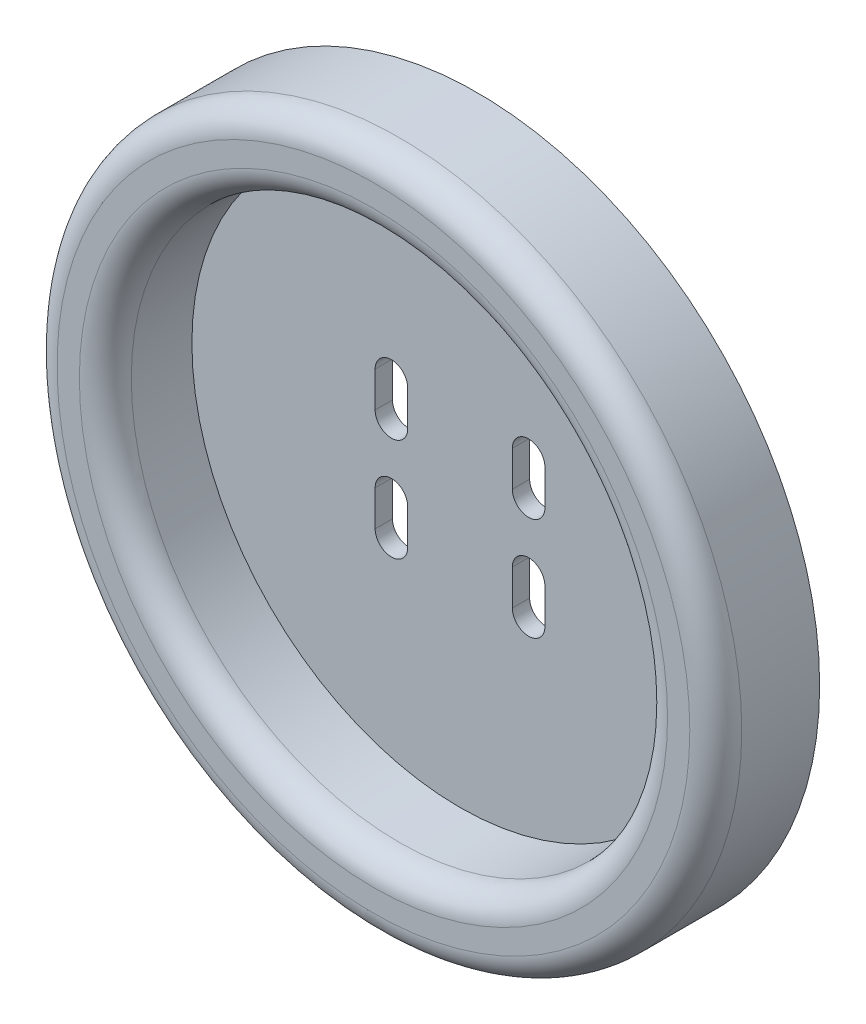
ISO-10303-21;
HEADER;
FILE_DESCRIPTION(('STEP AP214'),'2;1');
FILE_NAME('part.step','',(''),(''),'','','');
FILE_SCHEMA(('AUTOMOTIVE_DESIGN { 1 0 10303 214 1 1 1 1 }'));
ENDSEC;
DATA;
#1=APPLICATION_CONTEXT('core data for automotive mechanical design processes');
#2=APPLICATION_PROTOCOL_DEFINITION('international standard','automotive_design',2000,#1);
#3=PRODUCT_CONTEXT('',#1,'mechanical');
#4=PRODUCT('Part','Part','',(#3));
#5=PRODUCT_RELATED_PRODUCT_CATEGORY('part','',(#4));
#6=PRODUCT_DEFINITION_FORMATION('','',#4);
#7=PRODUCT_DEFINITION_CONTEXT('part definition',#1,'design');
#8=PRODUCT_DEFINITION('design','',#6,#7);
#9=PRODUCT_DEFINITION_SHAPE('','',#8);
#10=(LENGTH_UNIT() NAMED_UNIT(*) SI_UNIT(.MILLI.,.METRE.));
#11=(NAMED_UNIT(*) PLANE_ANGLE_UNIT() SI_UNIT($,.RADIAN.));
#12=(NAMED_UNIT(*) SI_UNIT($,.STERADIAN.) SOLID_ANGLE_UNIT());
#13=UNCERTAINTY_MEASURE_WITH_UNIT(LENGTH_MEASURE(1.E-05),#10,'distance_accuracy_value','');
#14=(GEOMETRIC_REPRESENTATION_CONTEXT(3) GLOBAL_UNCERTAINTY_ASSIGNED_CONTEXT((#13)) GLOBAL_UNIT_ASSIGNED_CONTEXT((#10,
#11,#12)) REPRESENTATION_CONTEXT('',''));
#15=CARTESIAN_POINT('',(0.,0.,0.));
#16=DIRECTION('',(0.,0.,1.));
#17=DIRECTION('',(1.,0.,0.));
#18=AXIS2_PLACEMENT_3D('',#15,#16,#17);
#19=CARTESIAN_POINT('',(0.,0.,12.));
#20=DIRECTION('',(0.,0.,-1.));
#21=DIRECTION('',(-1.,0.,0.));
#22=AXIS2_PLACEMENT_3D('',#19,#20,#21);
#23=CYLINDRICAL_SURFACE('',#22,39.5490349627969);
#24=CARTESIAN_POINT('',(0.,0.,9.));
#25=DIRECTION('',(0.,0.,1.));
#26=DIRECTION('',(1.,0.,0.));
#27=AXIS2_PLACEMENT_3D('',#24,#25,#26);
#28=CIRCLE('',#27,39.5490349627969);
#29=CARTESIAN_POINT('',(39.5490349627969,0.,9.));
#30=VERTEX_POINT('',#29);
#31=EDGE_CURVE('E298',#30,#30,#28,.F.);
#32=ORIENTED_EDGE('',*,*,#31,.T.);
#33=EDGE_LOOP('',(#32));
#34=FACE_BOUND('',#33,.T.);
#35=CARTESIAN_POINT('',(0.,0.,0.));
#36=DIRECTION('',(0.,0.,1.));
#37=DIRECTION('',(1.,0.,0.));
#38=AXIS2_PLACEMENT_3D('',#35,#36,#37);
#39=CIRCLE('',#38,39.5490349627969);
#40=CARTESIAN_POINT('',(39.5490349627969,0.,0.));
#41=VERTEX_POINT('',#40);
#42=EDGE_CURVE('E292',#41,#41,#39,.T.);
#43=ORIENTED_EDGE('',*,*,#42,.T.);
#44=EDGE_LOOP('',(#43));
#45=FACE_BOUND('',#44,.T.);
#46=ADVANCED_FACE('F40',(#34,#45),#23,.T.);
#47=CARTESIAN_POINT('',(0.,0.,12.));
#48=DIRECTION('',(0.,0.,1.));
#49=DIRECTION('',(1.,0.,0.));
#50=AXIS2_PLACEMENT_3D('',#47,#48,#49);
#51=PLANE('',#50);
#52=CARTESIAN_POINT('',(0.,0.,12.));
#53=DIRECTION('',(0.,0.,1.));
#54=DIRECTION('',(1.,0.,0.));
#55=AXIS2_PLACEMENT_3D('',#52,#53,#54);
#56=CIRCLE('',#55,33.9772404764855);
#57=CARTESIAN_POINT('',(33.9772404764855,0.,12.));
#58=VERTEX_POINT('',#57);
#59=EDGE_CURVE('E11',#58,#58,#56,.F.);
#60=ORIENTED_EDGE('',*,*,#59,.T.);
#61=EDGE_LOOP('',(#60));
#62=FACE_BOUND('',#61,.T.);
#63=CARTESIAN_POINT('',(0.,0.,12.));
#64=DIRECTION('',(0.,0.,1.));
#65=DIRECTION('',(1.,0.,0.));
#66=AXIS2_PLACEMENT_3D('',#63,#64,#65);
#67=CIRCLE('',#66,36.5490349627969);
#68=CARTESIAN_POINT('',(36.5490349627969,0.,12.));
#69=VERTEX_POINT('',#68);
#70=EDGE_CURVE('E295',#69,#69,#67,.T.);
#71=ORIENTED_EDGE('',*,*,#70,.T.);
#72=EDGE_LOOP('',(#71));
#73=FACE_BOUND('',#72,.T.);
#74=ADVANCED_FACE('F320',(#62,#73),#51,.T.);
#75=CARTESIAN_POINT('',(0.,0.,0.));
#76=DIRECTION('',(0.,0.,1.));
#77=DIRECTION('',(1.,0.,0.));
#78=AXIS2_PLACEMENT_3D('',#75,#76,#77);
#79=PLANE('',#78);
#80=DIRECTION('',(0.,-1.,0.));
#81=VECTOR('',#80,1.);
#82=CARTESIAN_POINT('',(-9.80571931531396,0.,0.));
#83=LINE('',#82,#81);
#84=CARTESIAN_POINT('',(-9.80571931531396,-3.89542274170003,0.));
#85=VERTEX_POINT('',#84);
#86=CARTESIAN_POINT('',(-9.80571931531396,-7.99233286659149,0.));
#87=VERTEX_POINT('',#86);
#88=EDGE_CURVE('E283',#85,#87,#83,.T.);
#89=ORIENTED_EDGE('',*,*,#88,.T.);
#90=CARTESIAN_POINT('',(-7.92517040552772,-7.99233286659149,0.));
#91=DIRECTION('',(0.,0.,1.));
#92=DIRECTION('',(1.,0.,0.));
#93=AXIS2_PLACEMENT_3D('',#90,#91,#92);
#94=CIRCLE('',#93,1.88054890978624);
#95=CARTESIAN_POINT('',(-6.04462149574148,-7.99233286659149,0.));
#96=VERTEX_POINT('',#95);
#97=EDGE_CURVE('E286',#87,#96,#94,.T.);
#98=ORIENTED_EDGE('',*,*,#97,.T.);
#99=DIRECTION('',(0.,1.,0.));
#100=VECTOR('',#99,1.);
#101=CARTESIAN_POINT('',(-6.04462149574148,0.,0.));
#102=LINE('',#101,#100);
#103=CARTESIAN_POINT('',(-6.04462149574148,-3.89542274170003,0.));
#104=VERTEX_POINT('',#103);
#105=EDGE_CURVE('E277',#96,#104,#102,.T.);
#106=ORIENTED_EDGE('',*,*,#105,.T.);
#107=CARTESIAN_POINT('',(-7.92517040552772,-3.89542274170003,0.));
#108=DIRECTION('',(0.,0.,1.));
#109=DIRECTION('',(1.,0.,0.));
#110=AXIS2_PLACEMENT_3D('',#107,#108,#109);
#111=CIRCLE('',#110,1.88054890978624);
#112=EDGE_CURVE('E280',#104,#85,#111,.T.);
#113=ORIENTED_EDGE('',*,*,#112,.T.);
#114=EDGE_LOOP('',(#89,#98,#106,#113));
#115=FACE_BOUND('',#114,.T.);
#116=DIRECTION('',(0.,-1.,0.));
#117=VECTOR('',#116,1.);
#118=CARTESIAN_POINT('',(6.04462149574148,0.,0.));
#119=LINE('',#118,#117);
#120=CARTESIAN_POINT('',(6.04462149574148,-3.89542274170003,0.));
#121=VERTEX_POINT('',#120);
#122=CARTESIAN_POINT('',(6.04462149574148,-7.99233286659149,0.));
#123=VERTEX_POINT('',#122);
#124=EDGE_CURVE('E271',#121,#123,#119,.T.);
#125=ORIENTED_EDGE('',*,*,#124,.T.);
#126=CARTESIAN_POINT('',(7.92517040552772,-7.99233286659149,0.));
#127=DIRECTION('',(0.,0.,1.));
#128=DIRECTION('',(1.,0.,0.));
#129=AXIS2_PLACEMENT_3D('',#126,#127,#128);
#130=CIRCLE('',#129,1.88054890978624);
#131=CARTESIAN_POINT('',(9.80571931531396,-7.99233286659149,0.));
#132=VERTEX_POINT('',#131);
#133=EDGE_CURVE('E274',#123,#132,#130,.T.);
#134=ORIENTED_EDGE('',*,*,#133,.T.);
#135=DIRECTION('',(0.,1.,0.));
#136=VECTOR('',#135,1.);
#137=CARTESIAN_POINT('',(9.80571931531396,0.,0.));
#138=LINE('',#137,#136);
#139=CARTESIAN_POINT('',(9.80571931531396,-3.89542274170003,0.));
#140=VERTEX_POINT('',#139);
#141=EDGE_CURVE('E265',#132,#140,#138,.T.);
#142=ORIENTED_EDGE('',*,*,#141,.T.);
#143=CARTESIAN_POINT('',(7.92517040552772,-3.89542274170003,0.));
#144=DIRECTION('',(0.,0.,1.));
#145=DIRECTION('',(1.,0.,0.));
#146=AXIS2_PLACEMENT_3D('',#143,#144,#145);
#147=CIRCLE('',#146,1.88054890978624);
#148=EDGE_CURVE('E268',#140,#121,#147,.T.);
#149=ORIENTED_EDGE('',*,*,#148,.T.);
#150=EDGE_LOOP('',(#125,#134,#142,#149));
#151=FACE_BOUND('',#150,.T.);
#152=DIRECTION('',(0.,1.,0.));
#153=VECTOR('',#152,1.);
#154=CARTESIAN_POINT('',(9.80571931531396,0.,0.));
#155=LINE('',#154,#153);
#156=CARTESIAN_POINT('',(9.80571931531396,3.89542274170003,0.));
#157=VERTEX_POINT('',#156);
#158=CARTESIAN_POINT('',(9.80571931531396,7.99233286659149,0.));
#159=VERTEX_POINT('',#158);
#160=EDGE_CURVE('E259',#157,#159,#155,.T.);
#161=ORIENTED_EDGE('',*,*,#160,.T.);
#162=CARTESIAN_POINT('',(7.92517040552772,7.99233286659149,0.));
#163=DIRECTION('',(0.,0.,1.));
#164=DIRECTION('',(1.,0.,0.));
#165=AXIS2_PLACEMENT_3D('',#162,#163,#164);
#166=CIRCLE('',#165,1.88054890978624);
#167=CARTESIAN_POINT('',(6.04462149574148,7.99233286659149,0.));
#168=VERTEX_POINT('',#167);
#169=EDGE_CURVE('E262',#159,#168,#166,.T.);
#170=ORIENTED_EDGE('',*,*,#169,.T.);
#171=DIRECTION('',(0.,-1.,0.));
#172=VECTOR('',#171,1.);
#173=CARTESIAN_POINT('',(6.04462149574148,0.,0.));
#174=LINE('',#173,#172);
#175=CARTESIAN_POINT('',(6.04462149574148,3.89542274170003,0.));
#176=VERTEX_POINT('',#175);
#177=EDGE_CURVE('E256',#168,#176,#174,.T.);
#178=ORIENTED_EDGE('',*,*,#177,.T.);
#179=CARTESIAN_POINT('',(7.92517040552772,3.89542274170003,0.));
#180=DIRECTION('',(0.,0.,1.));
#181=DIRECTION('',(1.,0.,0.));
#182=AXIS2_PLACEMENT_3D('',#179,#180,#181);
#183=CIRCLE('',#182,1.88054890978624);
#184=EDGE_CURVE('E161',#176,#157,#183,.T.);
#185=ORIENTED_EDGE('',*,*,#184,.T.);
#186=EDGE_LOOP('',(#161,#170,#178,#185));
#187=FACE_BOUND('',#186,.T.);
#188=DIRECTION('',(0.,1.,0.));
#189=VECTOR('',#188,1.);
#190=CARTESIAN_POINT('',(-6.04462149574148,0.,0.));
#191=LINE('',#190,#189);
#192=CARTESIAN_POINT('',(-6.04462149574148,3.89542274170003,0.));
#193=VERTEX_POINT('',#192);
#194=CARTESIAN_POINT('',(-6.04462149574148,7.99233286659149,0.));
#195=VERTEX_POINT('',#194);
#196=EDGE_CURVE('E250',#193,#195,#191,.T.);
#197=ORIENTED_EDGE('',*,*,#196,.T.);
#198=CARTESIAN_POINT('',(-7.92517040552772,7.99233286659149,0.));
#199=DIRECTION('',(0.,0.,1.));
#200=DIRECTION('',(1.,0.,0.));
#201=AXIS2_PLACEMENT_3D('',#198,#199,#200);
#202=CIRCLE('',#201,1.88054890978624);
#203=CARTESIAN_POINT('',(-9.80571931531396,7.99233286659149,0.));
#204=VERTEX_POINT('',#203);
#205=EDGE_CURVE('E253',#195,#204,#202,.T.);
#206=ORIENTED_EDGE('',*,*,#205,.T.);
#207=DIRECTION('',(0.,-1.,0.));
#208=VECTOR('',#207,1.);
#209=CARTESIAN_POINT('',(-9.80571931531396,0.,0.));
#210=LINE('',#209,#208);
#211=CARTESIAN_POINT('',(-9.80571931531396,3.89542274170003,0.));
#212=VERTEX_POINT('',#211);
#213=EDGE_CURVE('E238',#204,#212,#210,.T.);
#214=ORIENTED_EDGE('',*,*,#213,.T.);
#215=CARTESIAN_POINT('',(-7.92517040552772,3.89542274170003,0.));
#216=DIRECTION('',(0.,0.,1.));
#217=DIRECTION('',(1.,0.,0.));
#218=AXIS2_PLACEMENT_3D('',#215,#216,#217);
#219=CIRCLE('',#218,1.88054890978624);
#220=EDGE_CURVE('E247',#212,#193,#219,.T.);
#221=ORIENTED_EDGE('',*,*,#220,.T.);
#222=EDGE_LOOP('',(#197,#206,#214,#221));
#223=FACE_BOUND('',#222,.T.);
#224=ORIENTED_EDGE('',*,*,#42,.F.);
#225=EDGE_LOOP('',(#224));
#226=FACE_BOUND('',#225,.T.);
#227=ADVANCED_FACE('F326',(#115,#151,#187,#223,#226),#79,.F.);
#228=CARTESIAN_POINT('',(0.,0.,2.));
#229=DIRECTION('',(0.,0.,1.));
#230=DIRECTION('',(1.,0.,0.));
#231=AXIS2_PLACEMENT_3D('',#228,#229,#230);
#232=CYLINDRICAL_SURFACE('',#231,30.9772404764855);
#233=CARTESIAN_POINT('',(0.,0.,9.));
#234=DIRECTION('',(0.,0.,1.));
#235=DIRECTION('',(1.,0.,0.));
#236=AXIS2_PLACEMENT_3D('',#233,#234,#235);
#237=CIRCLE('',#236,30.9772404764855);
#238=CARTESIAN_POINT('',(30.9772404764855,0.,9.));
#239=VERTEX_POINT('',#238);
#240=EDGE_CURVE('E48',#239,#239,#237,.T.);
#241=ORIENTED_EDGE('',*,*,#240,.T.);
#242=EDGE_LOOP('',(#241));
#243=FACE_BOUND('',#242,.T.);
#244=CARTESIAN_POINT('',(0.,0.,2.));
#245=DIRECTION('',(0.,0.,1.));
#246=DIRECTION('',(1.,0.,0.));
#247=AXIS2_PLACEMENT_3D('',#244,#245,#246);
#248=CIRCLE('',#247,30.9772404764855);
#249=CARTESIAN_POINT('',(30.9772404764855,0.,2.));
#250=VERTEX_POINT('',#249);
#251=EDGE_CURVE('E289',#250,#250,#248,.T.);
#252=ORIENTED_EDGE('',*,*,#251,.F.);
#253=EDGE_LOOP('',(#252));
#254=FACE_BOUND('',#253,.T.);
#255=ADVANCED_FACE('F303',(#243,#254),#232,.F.);
#256=CARTESIAN_POINT('',(0.,0.,2.));
#257=DIRECTION('',(0.,0.,1.));
#258=DIRECTION('',(1.,0.,0.));
#259=AXIS2_PLACEMENT_3D('',#256,#257,#258);
#260=PLANE('',#259);
#261=CARTESIAN_POINT('',(-7.92517040552772,-7.99233286659149,2.));
#262=DIRECTION('',(0.,0.,1.));
#263=DIRECTION('',(-1.,0.,0.));
#264=AXIS2_PLACEMENT_3D('',#261,#262,#263);
#265=CIRCLE('',#264,1.88054890978624);
#266=CARTESIAN_POINT('',(-9.80571931531396,-7.99233286659149,2.));
#267=VERTEX_POINT('',#266);
#268=CARTESIAN_POINT('',(-6.04462149574148,-7.99233286659149,2.));
#269=VERTEX_POINT('',#268);
#270=EDGE_CURVE('E208',#267,#269,#265,.T.);
#271=ORIENTED_EDGE('',*,*,#270,.F.);
#272=DIRECTION('',(0.,-1.,0.));
#273=VECTOR('',#272,1.);
#274=CARTESIAN_POINT('',(-9.80571931531396,-7.99233286659149,2.));
#275=LINE('',#274,#273);
#276=CARTESIAN_POINT('',(-9.80571931531396,-3.89542274170003,2.));
#277=VERTEX_POINT('',#276);
#278=EDGE_CURVE('E215',#277,#267,#275,.T.);
#279=ORIENTED_EDGE('',*,*,#278,.F.);
#280=CARTESIAN_POINT('',(-7.92517040552772,-3.89542274170003,2.));
#281=DIRECTION('',(0.,0.,1.));
#282=DIRECTION('',(-1.,0.,0.));
#283=AXIS2_PLACEMENT_3D('',#280,#281,#282);
#284=CIRCLE('',#283,1.88054890978624);
#285=CARTESIAN_POINT('',(-6.04462149574148,-3.89542274170003,2.));
#286=VERTEX_POINT('',#285);
#287=EDGE_CURVE('E212',#286,#277,#284,.T.);
#288=ORIENTED_EDGE('',*,*,#287,.F.);
#289=DIRECTION('',(0.,1.,0.));
#290=VECTOR('',#289,1.);
#291=CARTESIAN_POINT('',(-6.04462149574148,-7.99233286659149,2.));
#292=LINE('',#291,#290);
#293=EDGE_CURVE('E210',#269,#286,#292,.T.);
#294=ORIENTED_EDGE('',*,*,#293,.F.);
#295=EDGE_LOOP('',(#271,#279,#288,#294));
#296=FACE_BOUND('',#295,.T.);
#297=CARTESIAN_POINT('',(7.92517040552772,-7.99233286659149,2.));
#298=DIRECTION('',(0.,0.,1.));
#299=DIRECTION('',(1.,0.,0.));
#300=AXIS2_PLACEMENT_3D('',#297,#298,#299);
#301=CIRCLE('',#300,1.88054890978624);
#302=CARTESIAN_POINT('',(6.04462149574148,-7.99233286659149,2.));
#303=VERTEX_POINT('',#302);
#304=CARTESIAN_POINT('',(9.80571931531396,-7.99233286659149,2.));
#305=VERTEX_POINT('',#304);
#306=EDGE_CURVE('E189',#303,#305,#301,.T.);
#307=ORIENTED_EDGE('',*,*,#306,.F.);
#308=DIRECTION('',(0.,-1.,0.));
#309=VECTOR('',#308,1.);
#310=CARTESIAN_POINT('',(6.04462149574148,-7.99233286659149,2.));
#311=LINE('',#310,#309);
#312=CARTESIAN_POINT('',(6.04462149574148,-3.89542274170003,2.));
#313=VERTEX_POINT('',#312);
#314=EDGE_CURVE('E197',#313,#303,#311,.T.);
#315=ORIENTED_EDGE('',*,*,#314,.F.);
#316=CARTESIAN_POINT('',(7.92517040552772,-3.89542274170003,2.));
#317=DIRECTION('',(0.,0.,1.));
#318=DIRECTION('',(1.,0.,0.));
#319=AXIS2_PLACEMENT_3D('',#316,#317,#318);
#320=CIRCLE('',#319,1.88054890978624);
#321=CARTESIAN_POINT('',(9.80571931531396,-3.89542274170003,2.));
#322=VERTEX_POINT('',#321);
#323=EDGE_CURVE('E194',#322,#313,#320,.T.);
#324=ORIENTED_EDGE('',*,*,#323,.F.);
#325=DIRECTION('',(0.,1.,0.));
#326=VECTOR('',#325,1.);
#327=CARTESIAN_POINT('',(9.80571931531396,-7.99233286659149,2.));
#328=LINE('',#327,#326);
#329=EDGE_CURVE('E191',#305,#322,#328,.T.);
#330=ORIENTED_EDGE('',*,*,#329,.F.);
#331=EDGE_LOOP('',(#307,#315,#324,#330));
#332=FACE_BOUND('',#331,.T.);
#333=CARTESIAN_POINT('',(7.92517040552772,7.99233286659149,2.));
#334=DIRECTION('',(0.,0.,1.));
#335=DIRECTION('',(-1.,0.,0.));
#336=AXIS2_PLACEMENT_3D('',#333,#334,#335);
#337=CIRCLE('',#336,1.88054890978624);
#338=CARTESIAN_POINT('',(9.80571931531396,7.99233286659149,2.));
#339=VERTEX_POINT('',#338);
#340=CARTESIAN_POINT('',(6.04462149574148,7.99233286659149,2.));
#341=VERTEX_POINT('',#340);
#342=EDGE_CURVE('E174',#339,#341,#337,.T.);
#343=ORIENTED_EDGE('',*,*,#342,.F.);
#344=DIRECTION('',(0.,1.,0.));
#345=VECTOR('',#344,1.);
#346=CARTESIAN_POINT('',(9.80571931531396,7.99233286659149,2.));
#347=LINE('',#346,#345);
#348=CARTESIAN_POINT('',(9.80571931531396,3.89542274170003,2.));
#349=VERTEX_POINT('',#348);
#350=EDGE_CURVE('E179',#349,#339,#347,.T.);
#351=ORIENTED_EDGE('',*,*,#350,.F.);
#352=CARTESIAN_POINT('',(7.92517040552772,3.89542274170003,2.));
#353=DIRECTION('',(0.,0.,1.));
#354=DIRECTION('',(-1.,0.,0.));
#355=AXIS2_PLACEMENT_3D('',#352,#353,#354);
#356=CIRCLE('',#355,1.88054890978624);
#357=CARTESIAN_POINT('',(6.04462149574148,3.89542274170003,2.));
#358=VERTEX_POINT('',#357);
#359=EDGE_CURVE('E158',#358,#349,#356,.T.);
#360=ORIENTED_EDGE('',*,*,#359,.F.);
#361=DIRECTION('',(0.,-1.,0.));
#362=VECTOR('',#361,1.);
#363=CARTESIAN_POINT('',(6.04462149574148,7.99233286659149,2.));
#364=LINE('',#363,#362);
#365=EDGE_CURVE('E169',#341,#358,#364,.T.);
#366=ORIENTED_EDGE('',*,*,#365,.F.);
#367=EDGE_LOOP('',(#343,#351,#360,#366));
#368=FACE_BOUND('',#367,.T.);
#369=CARTESIAN_POINT('',(-7.92517040552772,7.99233286659149,2.));
#370=DIRECTION('',(0.,0.,1.));
#371=DIRECTION('',(1.,0.,0.));
#372=AXIS2_PLACEMENT_3D('',#369,#370,#371);
#373=CIRCLE('',#372,1.88054890978624);
#374=CARTESIAN_POINT('',(-6.04462149574148,7.99233286659149,2.));
#375=VERTEX_POINT('',#374);
#376=CARTESIAN_POINT('',(-9.80571931531396,7.99233286659149,2.));
#377=VERTEX_POINT('',#376);
#378=EDGE_CURVE('E186',#375,#377,#373,.T.);
#379=ORIENTED_EDGE('',*,*,#378,.F.);
#380=DIRECTION('',(0.,1.,0.));
#381=VECTOR('',#380,1.);
#382=CARTESIAN_POINT('',(-6.04462149574148,7.99233286659149,2.));
#383=LINE('',#382,#381);
#384=CARTESIAN_POINT('',(-6.04462149574148,3.89542274170003,2.));
#385=VERTEX_POINT('',#384);
#386=EDGE_CURVE('E232',#385,#375,#383,.T.);
#387=ORIENTED_EDGE('',*,*,#386,.F.);
#388=CARTESIAN_POINT('',(-7.92517040552772,3.89542274170003,2.));
#389=DIRECTION('',(0.,0.,1.));
#390=DIRECTION('',(1.,0.,0.));
#391=AXIS2_PLACEMENT_3D('',#388,#389,#390);
#392=CIRCLE('',#391,1.88054890978624);
#393=CARTESIAN_POINT('',(-9.80571931531396,3.89542274170003,2.));
#394=VERTEX_POINT('',#393);
#395=EDGE_CURVE('E229',#394,#385,#392,.T.);
#396=ORIENTED_EDGE('',*,*,#395,.F.);
#397=DIRECTION('',(0.,-1.,0.));
#398=VECTOR('',#397,1.);
#399=CARTESIAN_POINT('',(-9.80571931531396,7.99233286659149,2.));
#400=LINE('',#399,#398);
#401=EDGE_CURVE('E226',#377,#394,#400,.T.);
#402=ORIENTED_EDGE('',*,*,#401,.F.);
#403=EDGE_LOOP('',(#379,#387,#396,#402));
#404=FACE_BOUND('',#403,.T.);
#405=ORIENTED_EDGE('',*,*,#251,.T.);
#406=EDGE_LOOP('',(#405));
#407=FACE_BOUND('',#406,.T.);
#408=ADVANCED_FACE('F176',(#296,#332,#368,#404,#407),#260,.T.);
#409=CARTESIAN_POINT('',(0.,0.,9.));
#410=DIRECTION('',(0.,0.,1.));
#411=DIRECTION('',(1.,0.,0.));
#412=AXIS2_PLACEMENT_3D('',#409,#410,#411);
#413=TOROIDAL_SURFACE('',#412,36.5490349627969,3.);
#414=ORIENTED_EDGE('',*,*,#31,.F.);
#415=EDGE_LOOP('',(#414));
#416=FACE_BOUND('',#415,.T.);
#417=ORIENTED_EDGE('',*,*,#70,.F.);
#418=EDGE_LOOP('',(#417));
#419=FACE_BOUND('',#418,.T.);
#420=ADVANCED_FACE('F308',(#416,#419),#413,.T.);
#421=CARTESIAN_POINT('',(0.,0.,9.));
#422=DIRECTION('',(0.,0.,1.));
#423=DIRECTION('',(1.,0.,0.));
#424=AXIS2_PLACEMENT_3D('',#421,#422,#423);
#425=TOROIDAL_SURFACE('',#424,33.9772404764855,3.);
#426=ORIENTED_EDGE('',*,*,#59,.F.);
#427=EDGE_LOOP('',(#426));
#428=FACE_BOUND('',#427,.T.);
#429=ORIENTED_EDGE('',*,*,#240,.F.);
#430=EDGE_LOOP('',(#429));
#431=FACE_BOUND('',#430,.T.);
#432=ADVANCED_FACE('F42',(#428,#431),#425,.T.);
#433=CARTESIAN_POINT('',(-7.92517040552772,7.99233286659149,-8.));
#434=DIRECTION('',(0.,0.,1.));
#435=DIRECTION('',(1.,0.,0.));
#436=AXIS2_PLACEMENT_3D('',#433,#434,#435);
#437=CYLINDRICAL_SURFACE('',#436,1.88054890978624);
#438=DIRECTION('',(0.,0.,1.));
#439=VECTOR('',#438,1.);
#440=CARTESIAN_POINT('',(-6.04462149574148,7.99233286659149,-8.));
#441=LINE('',#440,#439);
#442=EDGE_CURVE('E236',#195,#375,#441,.T.);
#443=ORIENTED_EDGE('',*,*,#442,.T.);
#444=ORIENTED_EDGE('',*,*,#378,.T.);
#445=DIRECTION('',(0.,0.,1.));
#446=VECTOR('',#445,1.);
#447=CARTESIAN_POINT('',(-9.80571931531396,7.99233286659149,-8.));
#448=LINE('',#447,#446);
#449=EDGE_CURVE('E235',#204,#377,#448,.T.);
#450=ORIENTED_EDGE('',*,*,#449,.F.);
#451=ORIENTED_EDGE('',*,*,#205,.F.);
#452=EDGE_LOOP('',(#443,#444,#450,#451));
#453=FACE_BOUND('',#452,.T.);
#454=ADVANCED_FACE('F307',(#453),#437,.F.);
#455=CARTESIAN_POINT('',(-6.04462149574148,7.99233286659149,-8.));
#456=DIRECTION('',(1.,0.,0.));
#457=DIRECTION('',(0.,0.,-1.));
#458=AXIS2_PLACEMENT_3D('',#455,#456,#457);
#459=PLANE('',#458);
#460=DIRECTION('',(0.,0.,1.));
#461=VECTOR('',#460,1.);
#462=CARTESIAN_POINT('',(-6.04462149574148,3.89542274170003,-8.));
#463=LINE('',#462,#461);
#464=EDGE_CURVE('E239',#193,#385,#463,.T.);
#465=ORIENTED_EDGE('',*,*,#464,.T.);
#466=ORIENTED_EDGE('',*,*,#386,.T.);
#467=ORIENTED_EDGE('',*,*,#442,.F.);
#468=ORIENTED_EDGE('',*,*,#196,.F.);
#469=EDGE_LOOP('',(#465,#466,#467,#468));
#470=FACE_BOUND('',#469,.T.);
#471=ADVANCED_FACE('F314',(#470),#459,.F.);
#472=CARTESIAN_POINT('',(-7.92517040552772,3.89542274170003,-8.));
#473=DIRECTION('',(0.,0.,1.));
#474=DIRECTION('',(1.,0.,0.));
#475=AXIS2_PLACEMENT_3D('',#472,#473,#474);
#476=CYLINDRICAL_SURFACE('',#475,1.88054890978624);
#477=DIRECTION('',(0.,0.,1.));
#478=VECTOR('',#477,1.);
#479=CARTESIAN_POINT('',(-9.80571931531396,3.89542274170003,-8.));
#480=LINE('',#479,#478);
#481=EDGE_CURVE('E241',#212,#394,#480,.T.);
#482=ORIENTED_EDGE('',*,*,#481,.T.);
#483=ORIENTED_EDGE('',*,*,#395,.T.);
#484=ORIENTED_EDGE('',*,*,#464,.F.);
#485=ORIENTED_EDGE('',*,*,#220,.F.);
#486=EDGE_LOOP('',(#482,#483,#484,#485));
#487=FACE_BOUND('',#486,.T.);
#488=ADVANCED_FACE('F343',(#487),#476,.F.);
#489=CARTESIAN_POINT('',(-9.80571931531396,7.99233286659149,-8.));
#490=DIRECTION('',(-1.,0.,0.));
#491=DIRECTION('',(0.,0.,1.));
#492=AXIS2_PLACEMENT_3D('',#489,#490,#491);
#493=PLANE('',#492);
#494=ORIENTED_EDGE('',*,*,#449,.T.);
#495=ORIENTED_EDGE('',*,*,#401,.T.);
#496=ORIENTED_EDGE('',*,*,#481,.F.);
#497=ORIENTED_EDGE('',*,*,#213,.F.);
#498=EDGE_LOOP('',(#494,#495,#496,#497));
#499=FACE_BOUND('',#498,.T.);
#500=ADVANCED_FACE('F339',(#499),#493,.F.);
#501=CARTESIAN_POINT('',(7.92517040552772,7.99233286659149,-8.));
#502=DIRECTION('',(0.,0.,1.));
#503=DIRECTION('',(1.,0.,0.));
#504=AXIS2_PLACEMENT_3D('',#501,#502,#503);
#505=CYLINDRICAL_SURFACE('',#504,1.88054890978624);
#506=DIRECTION('',(0.,0.,1.));
#507=VECTOR('',#506,1.);
#508=CARTESIAN_POINT('',(9.80571931531396,7.99233286659149,-8.));
#509=LINE('',#508,#507);
#510=EDGE_CURVE('E184',#159,#339,#509,.T.);
#511=ORIENTED_EDGE('',*,*,#510,.T.);
#512=ORIENTED_EDGE('',*,*,#342,.T.);
#513=DIRECTION('',(0.,0.,1.));
#514=VECTOR('',#513,1.);
#515=CARTESIAN_POINT('',(6.04462149574148,7.99233286659149,-8.));
#516=LINE('',#515,#514);
#517=EDGE_CURVE('E165',#168,#341,#516,.T.);
#518=ORIENTED_EDGE('',*,*,#517,.F.);
#519=ORIENTED_EDGE('',*,*,#169,.F.);
#520=EDGE_LOOP('',(#511,#512,#518,#519));
#521=FACE_BOUND('',#520,.T.);
#522=ADVANCED_FACE('F342',(#521),#505,.F.);
#523=CARTESIAN_POINT('',(9.80571931531396,7.99233286659149,-8.));
#524=DIRECTION('',(1.,0.,0.));
#525=DIRECTION('',(0.,0.,-1.));
#526=AXIS2_PLACEMENT_3D('',#523,#524,#525);
#527=PLANE('',#526);
#528=DIRECTION('',(0.,0.,1.));
#529=VECTOR('',#528,1.);
#530=CARTESIAN_POINT('',(9.80571931531396,3.89542274170003,-8.));
#531=LINE('',#530,#529);
#532=EDGE_CURVE('E164',#157,#349,#531,.T.);
#533=ORIENTED_EDGE('',*,*,#532,.T.);
#534=ORIENTED_EDGE('',*,*,#350,.T.);
#535=ORIENTED_EDGE('',*,*,#510,.F.);
#536=ORIENTED_EDGE('',*,*,#160,.F.);
#537=EDGE_LOOP('',(#533,#534,#535,#536));
#538=FACE_BOUND('',#537,.T.);
#539=ADVANCED_FACE('F383',(#538),#527,.F.);
#540=CARTESIAN_POINT('',(7.92517040552772,3.89542274170003,-8.));
#541=DIRECTION('',(0.,0.,1.));
#542=DIRECTION('',(1.,0.,0.));
#543=AXIS2_PLACEMENT_3D('',#540,#541,#542);
#544=CYLINDRICAL_SURFACE('',#543,1.88054890978624);
#545=DIRECTION('',(0.,0.,1.));
#546=VECTOR('',#545,1.);
#547=CARTESIAN_POINT('',(6.04462149574148,3.89542274170003,-8.));
#548=LINE('',#547,#546);
#549=EDGE_CURVE('E153',#176,#358,#548,.T.);
#550=ORIENTED_EDGE('',*,*,#549,.T.);
#551=ORIENTED_EDGE('',*,*,#359,.T.);
#552=ORIENTED_EDGE('',*,*,#532,.F.);
#553=ORIENTED_EDGE('',*,*,#184,.F.);
#554=EDGE_LOOP('',(#550,#551,#552,#553));
#555=FACE_BOUND('',#554,.T.);
#556=ADVANCED_FACE('F155',(#555),#544,.F.);
#557=CARTESIAN_POINT('',(6.04462149574148,7.99233286659149,-8.));
#558=DIRECTION('',(-1.,0.,0.));
#559=DIRECTION('',(0.,0.,1.));
#560=AXIS2_PLACEMENT_3D('',#557,#558,#559);
#561=PLANE('',#560);
#562=ORIENTED_EDGE('',*,*,#517,.T.);
#563=ORIENTED_EDGE('',*,*,#365,.T.);
#564=ORIENTED_EDGE('',*,*,#549,.F.);
#565=ORIENTED_EDGE('',*,*,#177,.F.);
#566=EDGE_LOOP('',(#562,#563,#564,#565));
#567=FACE_BOUND('',#566,.T.);
#568=ADVANCED_FACE('F170',(#567),#561,.F.);
#569=CARTESIAN_POINT('',(7.92517040552772,-7.99233286659149,-8.));
#570=DIRECTION('',(0.,0.,1.));
#571=DIRECTION('',(1.,0.,0.));
#572=AXIS2_PLACEMENT_3D('',#569,#570,#571);
#573=CYLINDRICAL_SURFACE('',#572,1.88054890978624);
#574=DIRECTION('',(0.,0.,1.));
#575=VECTOR('',#574,1.);
#576=CARTESIAN_POINT('',(6.04462149574148,-7.99233286659149,-8.));
#577=LINE('',#576,#575);
#578=EDGE_CURVE('E201',#123,#303,#577,.T.);
#579=ORIENTED_EDGE('',*,*,#578,.T.);
#580=ORIENTED_EDGE('',*,*,#306,.T.);
#581=DIRECTION('',(0.,0.,1.));
#582=VECTOR('',#581,1.);
#583=CARTESIAN_POINT('',(9.80571931531396,-7.99233286659149,-8.));
#584=LINE('',#583,#582);
#585=EDGE_CURVE('E200',#132,#305,#584,.T.);
#586=ORIENTED_EDGE('',*,*,#585,.F.);
#587=ORIENTED_EDGE('',*,*,#133,.F.);
#588=EDGE_LOOP('',(#579,#580,#586,#587));
#589=FACE_BOUND('',#588,.T.);
#590=ADVANCED_FACE('F367',(#589),#573,.F.);
#591=CARTESIAN_POINT('',(6.04462149574148,-7.99233286659149,-8.));
#592=DIRECTION('',(-1.,0.,0.));
#593=DIRECTION('',(0.,0.,1.));
#594=AXIS2_PLACEMENT_3D('',#591,#592,#593);
#595=PLANE('',#594);
#596=DIRECTION('',(0.,0.,1.));
#597=VECTOR('',#596,1.);
#598=CARTESIAN_POINT('',(6.04462149574148,-3.89542274170003,-8.));
#599=LINE('',#598,#597);
#600=EDGE_CURVE('E203',#121,#313,#599,.T.);
#601=ORIENTED_EDGE('',*,*,#600,.T.);
#602=ORIENTED_EDGE('',*,*,#314,.T.);
#603=ORIENTED_EDGE('',*,*,#578,.F.);
#604=ORIENTED_EDGE('',*,*,#124,.F.);
#605=EDGE_LOOP('',(#601,#602,#603,#604));
#606=FACE_BOUND('',#605,.T.);
#607=ADVANCED_FACE('F370',(#606),#595,.F.);
#608=CARTESIAN_POINT('',(7.92517040552772,-3.89542274170003,-8.));
#609=DIRECTION('',(0.,0.,1.));
#610=DIRECTION('',(1.,0.,0.));
#611=AXIS2_PLACEMENT_3D('',#608,#609,#610);
#612=CYLINDRICAL_SURFACE('',#611,1.88054890978624);
#613=DIRECTION('',(0.,0.,1.));
#614=VECTOR('',#613,1.);
#615=CARTESIAN_POINT('',(9.80571931531396,-3.89542274170003,-8.));
#616=LINE('',#615,#614);
#617=EDGE_CURVE('E63',#140,#322,#616,.T.);
#618=ORIENTED_EDGE('',*,*,#617,.T.);
#619=ORIENTED_EDGE('',*,*,#323,.T.);
#620=ORIENTED_EDGE('',*,*,#600,.F.);
#621=ORIENTED_EDGE('',*,*,#148,.F.);
#622=EDGE_LOOP('',(#618,#619,#620,#621));
#623=FACE_BOUND('',#622,.T.);
#624=ADVANCED_FACE('F374',(#623),#612,.F.);
#625=CARTESIAN_POINT('',(9.80571931531396,-7.99233286659149,-8.));
#626=DIRECTION('',(1.,0.,0.));
#627=DIRECTION('',(0.,0.,-1.));
#628=AXIS2_PLACEMENT_3D('',#625,#626,#627);
#629=PLANE('',#628);
#630=ORIENTED_EDGE('',*,*,#585,.T.);
#631=ORIENTED_EDGE('',*,*,#329,.T.);
#632=ORIENTED_EDGE('',*,*,#617,.F.);
#633=ORIENTED_EDGE('',*,*,#141,.F.);
#634=EDGE_LOOP('',(#630,#631,#632,#633));
#635=FACE_BOUND('',#634,.T.);
#636=ADVANCED_FACE('F355',(#635),#629,.F.);
#637=CARTESIAN_POINT('',(-7.92517040552772,-7.99233286659149,-8.));
#638=DIRECTION('',(0.,0.,1.));
#639=DIRECTION('',(1.,0.,0.));
#640=AXIS2_PLACEMENT_3D('',#637,#638,#639);
#641=CYLINDRICAL_SURFACE('',#640,1.88054890978624);
#642=DIRECTION('',(0.,0.,1.));
#643=VECTOR('',#642,1.);
#644=CARTESIAN_POINT('',(-9.80571931531396,-7.99233286659149,-8.));
#645=LINE('',#644,#643);
#646=EDGE_CURVE('E192',#87,#267,#645,.T.);
#647=ORIENTED_EDGE('',*,*,#646,.T.);
#648=ORIENTED_EDGE('',*,*,#270,.T.);
#649=DIRECTION('',(0.,0.,1.));
#650=VECTOR('',#649,1.);
#651=CARTESIAN_POINT('',(-6.04462149574148,-7.99233286659149,-8.));
#652=LINE('',#651,#650);
#653=EDGE_CURVE('E218',#96,#269,#652,.T.);
#654=ORIENTED_EDGE('',*,*,#653,.F.);
#655=ORIENTED_EDGE('',*,*,#97,.F.);
#656=EDGE_LOOP('',(#647,#648,#654,#655));
#657=FACE_BOUND('',#656,.T.);
#658=ADVANCED_FACE('F351',(#657),#641,.F.);
#659=CARTESIAN_POINT('',(-9.80571931531396,-7.99233286659149,-8.));
#660=DIRECTION('',(-1.,0.,0.));
#661=DIRECTION('',(0.,0.,1.));
#662=AXIS2_PLACEMENT_3D('',#659,#660,#661);
#663=PLANE('',#662);
#664=DIRECTION('',(0.,0.,1.));
#665=VECTOR('',#664,1.);
#666=CARTESIAN_POINT('',(-9.80571931531396,-3.89542274170003,-8.));
#667=LINE('',#666,#665);
#668=EDGE_CURVE('E220',#85,#277,#667,.T.);
#669=ORIENTED_EDGE('',*,*,#668,.T.);
#670=ORIENTED_EDGE('',*,*,#278,.T.);
#671=ORIENTED_EDGE('',*,*,#646,.F.);
#672=ORIENTED_EDGE('',*,*,#88,.F.);
#673=EDGE_LOOP('',(#669,#670,#671,#672));
#674=FACE_BOUND('',#673,.T.);
#675=ADVANCED_FACE('F354',(#674),#663,.F.);
#676=CARTESIAN_POINT('',(-7.92517040552772,-3.89542274170003,-8.));
#677=DIRECTION('',(0.,0.,1.));
#678=DIRECTION('',(1.,0.,0.));
#679=AXIS2_PLACEMENT_3D('',#676,#677,#678);
#680=CYLINDRICAL_SURFACE('',#679,1.88054890978624);
#681=DIRECTION('',(0.,0.,1.));
#682=VECTOR('',#681,1.);
#683=CARTESIAN_POINT('',(-6.04462149574148,-3.89542274170003,-8.));
#684=LINE('',#683,#682);
#685=EDGE_CURVE('E55',#104,#286,#684,.T.);
#686=ORIENTED_EDGE('',*,*,#685,.T.);
#687=ORIENTED_EDGE('',*,*,#287,.T.);
#688=ORIENTED_EDGE('',*,*,#668,.F.);
#689=ORIENTED_EDGE('',*,*,#112,.F.);
#690=EDGE_LOOP('',(#686,#687,#688,#689));
#691=FACE_BOUND('',#690,.T.);
#692=ADVANCED_FACE('F360',(#691),#680,.F.);
#693=CARTESIAN_POINT('',(-6.04462149574148,-7.99233286659149,-8.));
#694=DIRECTION('',(1.,0.,0.));
#695=DIRECTION('',(0.,0.,-1.));
#696=AXIS2_PLACEMENT_3D('',#693,#694,#695);
#697=PLANE('',#696);
#698=ORIENTED_EDGE('',*,*,#653,.T.);
#699=ORIENTED_EDGE('',*,*,#293,.T.);
#700=ORIENTED_EDGE('',*,*,#685,.F.);
#701=ORIENTED_EDGE('',*,*,#105,.F.);
#702=EDGE_LOOP('',(#698,#699,#700,#701));
#703=FACE_BOUND('',#702,.T.);
#704=ADVANCED_FACE('F357',(#703),#697,.F.);
#705=CLOSED_SHELL('',(#46,#74,#227,#255,#408,#420,#432,#454,#471,#488,#500,#522,#539,#556,#568,
#590,#607,#624,#636,#658,#675,#692,#704));
#706=MANIFOLD_SOLID_BREP('B2',#705);
#707=ADVANCED_BREP_SHAPE_REPRESENTATION('',(#18,#706),#14);
#708=SHAPE_DEFINITION_REPRESENTATION(#9,#707);
ENDSEC;
END-ISO-10303-21;
